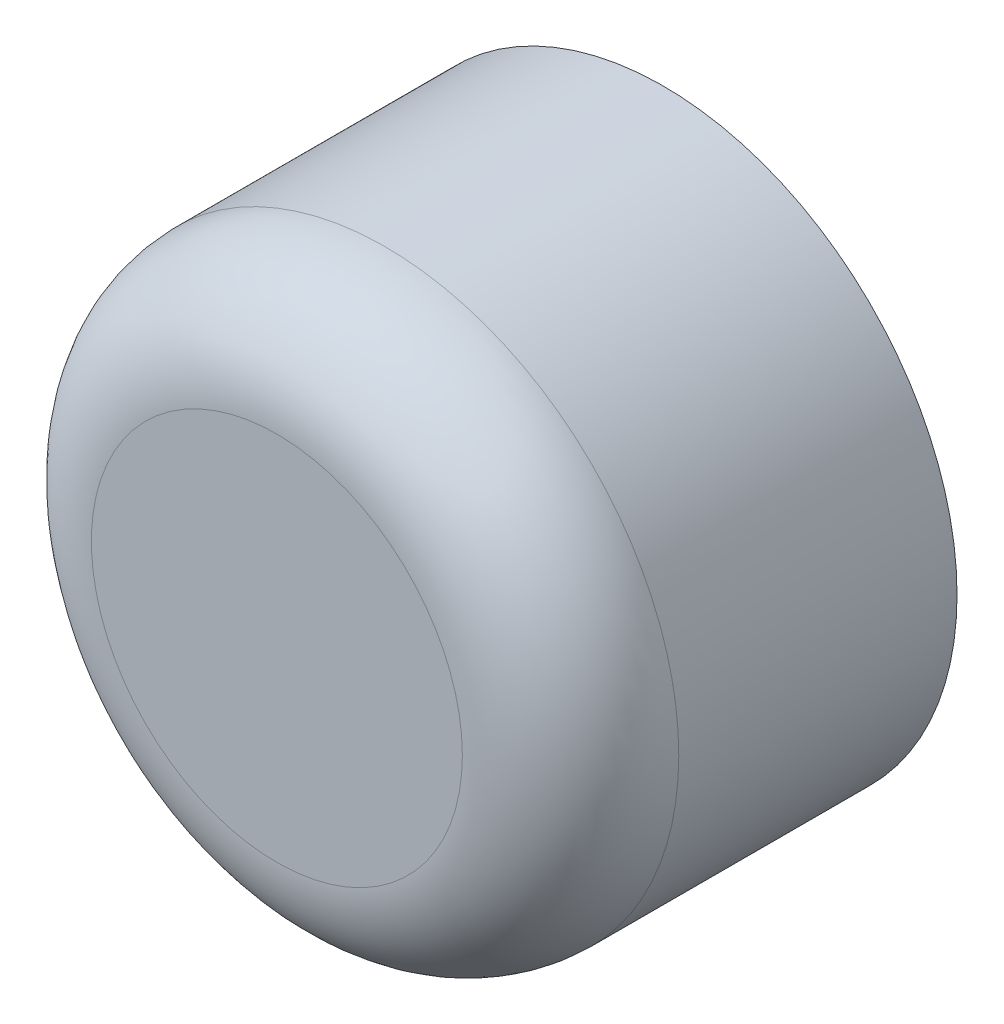
ISO-10303-21;
HEADER;
FILE_DESCRIPTION(('STEP AP214'),'2;1');
FILE_NAME('part.step','',(''),(''),'','','');
FILE_SCHEMA(('AUTOMOTIVE_DESIGN { 1 0 10303 214 1 1 1 1 }'));
ENDSEC;
DATA;
#1=APPLICATION_CONTEXT('core data for automotive mechanical design processes');
#2=APPLICATION_PROTOCOL_DEFINITION('international standard','automotive_design',2000,#1);
#3=PRODUCT_CONTEXT('',#1,'mechanical');
#4=PRODUCT('Part','Part','',(#3));
#5=PRODUCT_RELATED_PRODUCT_CATEGORY('part','',(#4));
#6=PRODUCT_DEFINITION_FORMATION('','',#4);
#7=PRODUCT_DEFINITION_CONTEXT('part definition',#1,'design');
#8=PRODUCT_DEFINITION('design','',#6,#7);
#9=PRODUCT_DEFINITION_SHAPE('','',#8);
#10=(LENGTH_UNIT() NAMED_UNIT(*) SI_UNIT(.MILLI.,.METRE.));
#11=(NAMED_UNIT(*) PLANE_ANGLE_UNIT() SI_UNIT($,.RADIAN.));
#12=(NAMED_UNIT(*) SI_UNIT($,.STERADIAN.) SOLID_ANGLE_UNIT());
#13=UNCERTAINTY_MEASURE_WITH_UNIT(LENGTH_MEASURE(1.E-05),#10,'distance_accuracy_value','');
#14=(GEOMETRIC_REPRESENTATION_CONTEXT(3) GLOBAL_UNCERTAINTY_ASSIGNED_CONTEXT((#13)) GLOBAL_UNIT_ASSIGNED_CONTEXT((#10,
#11,#12)) REPRESENTATION_CONTEXT('',''));
#15=CARTESIAN_POINT('',(0.,0.,0.));
#16=DIRECTION('',(0.,0.,1.));
#17=DIRECTION('',(1.,0.,0.));
#18=AXIS2_PLACEMENT_3D('',#15,#16,#17);
#19=CARTESIAN_POINT('',(0.,0.,25.));
#20=DIRECTION('',(0.,0.,-1.));
#21=DIRECTION('',(-1.,0.,0.));
#22=AXIS2_PLACEMENT_3D('',#19,#20,#21);
#23=CYLINDRICAL_SURFACE('',#22,19.);
#24=CARTESIAN_POINT('',(0.,0.,18.));
#25=DIRECTION('',(0.,0.,1.));
#26=DIRECTION('',(1.,0.,0.));
#27=AXIS2_PLACEMENT_3D('',#24,#25,#26);
#28=CIRCLE('',#27,19.);
#29=CARTESIAN_POINT('',(19.,0.,18.));
#30=VERTEX_POINT('',#29);
#31=EDGE_CURVE('E10',#30,#30,#28,.F.);
#32=ORIENTED_EDGE('',*,*,#31,.T.);
#33=EDGE_LOOP('',(#32));
#34=FACE_BOUND('',#33,.T.);
#35=CARTESIAN_POINT('',(0.,-19.,11.1));
#36=CARTESIAN_POINT('',(-0.0617320040500549,-18.9999995756223,11.0999972804819));
#37=CARTESIAN_POINT('',(-0.123507451000114,-18.999695924853,11.0947859408961));
#38=CARTESIAN_POINT('',(-0.24535321333721,-18.998513793972,11.0740713215878));
#39=CARTESIAN_POINT('',(-0.305421448691984,-18.9976346415817,11.0585560048509));
#40=CARTESIAN_POINT('',(-0.422070166304976,-18.9954009827337,11.017680001208));
#41=CARTESIAN_POINT('',(-0.478652446088216,-18.9940467237168,10.992324438481));
#42=CARTESIAN_POINT('',(-0.586742750131653,-18.9910152490377,10.9324958325482));
#43=CARTESIAN_POINT('',(-0.638251946769572,-18.9893381082587,10.8980249026999));
#44=CARTESIAN_POINT('',(-0.734816184503076,-18.9858469988556,10.8208944995453));
#45=CARTESIAN_POINT('',(-0.779863746133681,-18.9840328753186,10.7782256684934));
#46=CARTESIAN_POINT('',(-0.862162088976615,-18.9804735900862,10.6859297729961));
#47=CARTESIAN_POINT('',(-0.899412547300006,-18.978728431249,10.6363024205306));
#48=CARTESIAN_POINT('',(-0.965081566797601,-18.9755027123895,10.5314568441288));
#49=CARTESIAN_POINT('',(-0.993494031569768,-18.9740223353102,10.4762347956563));
#50=CARTESIAN_POINT('',(-1.04064149858644,-18.9714950896691,10.3617942282788));
#51=CARTESIAN_POINT('',(-1.05937659280397,-18.9704482169875,10.3025757473616));
#52=CARTESIAN_POINT('',(-1.08661705093427,-18.9689074875675,10.1818943610569));
#53=CARTESIAN_POINT('',(-1.09513396892365,-18.9684130062631,10.1204340717818));
#54=CARTESIAN_POINT('',(-1.10173197114491,-18.9680309500149,9.99695434914613));
#55=CARTESIAN_POINT('',(-1.09981315943117,-18.9681433690197,9.93493492136684));
#56=CARTESIAN_POINT('',(-1.08560377064927,-18.9689618558727,9.81217607706893));
#57=CARTESIAN_POINT('',(-1.0733256885909,-18.9696672085402,9.75143520881738));
#58=CARTESIAN_POINT('',(-1.03876566287628,-18.9715909430879,9.63287808265456));
#59=CARTESIAN_POINT('',(-1.01648366623108,-18.9728093276854,9.57506184023629));
#60=CARTESIAN_POINT('',(-0.9625340967885,-18.9756226384643,9.46395496787695));
#61=CARTESIAN_POINT('',(-0.930860844637545,-18.9772177923775,9.41066710162893));
#62=CARTESIAN_POINT('',(-0.85903197484002,-18.980604638557,9.31015984722272));
#63=CARTESIAN_POINT('',(-0.818876275819526,-18.9823963327088,9.26294051728828));
#64=CARTESIAN_POINT('',(-0.731151957191535,-18.9859775127357,9.17583801060137));
#65=CARTESIAN_POINT('',(-0.683572521402879,-18.9877669914869,9.1359657261379));
#66=CARTESIAN_POINT('',(-0.582389289587574,-18.9911395316736,9.06477312185726));
#67=CARTESIAN_POINT('',(-0.528785491721799,-18.9927225930461,9.03345280465085));
#68=CARTESIAN_POINT('',(-0.417068636149907,-18.9955040037363,8.98025417346377));
#69=CARTESIAN_POINT('',(-0.358955387652741,-18.9967023367653,8.95837625924045));
#70=CARTESIAN_POINT('',(-0.239872153805753,-18.9985790225836,8.9246906819236));
#71=CARTESIAN_POINT('',(-0.178902197101453,-18.9992573805856,8.91288291787486));
#72=CARTESIAN_POINT('',(-0.0559307862300104,-19.0000170003874,8.8996862882731));
#73=CARTESIAN_POINT('',(0.00606904645360722,-19.0000991253795,8.89828236057508));
#74=CARTESIAN_POINT('',(0.129423361025398,-18.9996593186888,8.90589391983453));
#75=CARTESIAN_POINT('',(0.190777845787524,-18.9991373896971,8.91490936037117));
#76=CARTESIAN_POINT('',(0.311057493825413,-18.9975487985834,8.94309127137715));
#77=CARTESIAN_POINT('',(0.369984278497294,-18.9964825066161,8.9622508443879));
#78=CARTESIAN_POINT('',(0.483785817705781,-18.9939251856388,9.01017015028812));
#79=CARTESIAN_POINT('',(0.538660540940977,-18.9924341533482,9.0389299573281));
#80=CARTESIAN_POINT('',(0.64286931375091,-18.9891928156946,9.10527177575751));
#81=CARTESIAN_POINT('',(0.692196940478747,-18.9874422151102,9.1428638614258));
#82=CARTESIAN_POINT('',(0.783846663377566,-18.98387979614,9.2257884504599));
#83=CARTESIAN_POINT('',(0.82616870007123,-18.9820679772347,9.27112101953563));
#84=CARTESIAN_POINT('',(0.902656775402082,-18.9785848423375,9.3683046603294));
#85=CARTESIAN_POINT('',(0.93681305281082,-18.9769136960337,9.42016342149935));
#86=CARTESIAN_POINT('',(0.995933291472939,-18.9739030484457,9.52888864037129));
#87=CARTESIAN_POINT('',(1.02089730286744,-18.9725635453525,9.58575507075581));
#88=CARTESIAN_POINT('',(1.06090742304525,-18.9703684589054,9.70284554444452));
#89=CARTESIAN_POINT('',(1.07595970663483,-18.9695125743143,9.76306747192779));
#90=CARTESIAN_POINT('',(1.09573927001406,-18.9683804030387,9.88518893563099));
#91=CARTESIAN_POINT('',(1.10046663495124,-18.9681041115743,9.94708845801189));
#92=CARTESIAN_POINT('',(1.09946136166685,-18.9681623996433,10.070710918238));
#93=CARTESIAN_POINT('',(1.09374407285783,-18.9684960827613,10.1324339819122));
#94=CARTESIAN_POINT('',(1.0720435722136,-18.9697348180291,10.2540422482185));
#95=CARTESIAN_POINT('',(1.05606034136719,-18.970639871237,10.313927447447));
#96=CARTESIAN_POINT('',(1.01428500598485,-18.9729191360926,10.4301626967544));
#97=CARTESIAN_POINT('',(0.988492908832591,-18.9742933473873,10.4865127494944));
#98=CARTESIAN_POINT('',(0.927834259495705,-18.9773560263943,10.5940843927976));
#99=CARTESIAN_POINT('',(0.892967959426748,-18.9790444853752,10.6453061257903));
#100=CARTESIAN_POINT('',(0.815094400602707,-18.9825482494595,10.7412446239999));
#101=CARTESIAN_POINT('',(0.772076163174159,-18.984363723517,10.7859524712889));
#102=CARTESIAN_POINT('',(0.679132394259068,-18.9879155565136,10.8675268067093));
#103=CARTESIAN_POINT('',(0.629205171759072,-18.9896518959454,10.9043913695299));
#104=CARTESIAN_POINT('',(0.523810839774369,-18.9928513664318,10.9692558986844));
#105=CARTESIAN_POINT('',(0.468337553215066,-18.9943141875265,10.997245832682));
#106=CARTESIAN_POINT('',(0.353511254108986,-18.9967974646851,11.0434806440717));
#107=CARTESIAN_POINT('',(0.294162893283999,-18.9978184403093,11.0617369729793));
#108=CARTESIAN_POINT('',(0.195374333112913,-18.9990344497459,11.0832241318225));
#109=CARTESIAN_POINT('',(0.156573223440549,-18.9993949289939,11.0895069884142));
#110=CARTESIAN_POINT('',(0.0785206019028414,-18.9998778389598,11.0978957850332));
#111=CARTESIAN_POINT('',(0.0392690905643024,-19.000000269956,11.1000017299455));
#112=CARTESIAN_POINT('',(0.,-19.,11.1));
#113=B_SPLINE_CURVE_WITH_KNOTS('',3,(#35,#36,#37,#38,#39,#40,#41,#42,#43,#44,#45,#46,#47,#48,
#49,#50,#51,#52,#53,#54,#55,#56,#57,#58,#59,#60,#61,#62,#63,#64,#65,#66,#67,#68,#69,#70,#71,#72,
#73,#74,#75,#76,#77,#78,#79,#80,#81,#82,#83,#84,#85,#86,#87,#88,#89,#90,#91,#92,#93,#94,#95,#96,
#97,#98,#99,#100,#101,#102,#103,#104,#105,#106,#107,#108,#109,#110,#111,#112),.UNSPECIFIED.,.T.,
.F.,(4,2,2,2,2,2,2,2,2,2,2,2,2,2,2,2,2,2,2,2,2,2,2,2,2,2,2,2,2,2,2,2,2,2,2,2,2,2,4),(0.,
0.185052660092687,0.370321878210842,0.555494748987009,0.740624725834711,0.925967294153065,
1.11131753624819,1.29679534989826,1.48227140074821,1.66753752858468,1.85280180914126,
2.03784294896751,2.22288506893505,2.40803932199883,2.59319535136758,2.77862371138395,
2.9640521280083,3.14948839423444,3.33492280140402,3.52008869352772,3.70525376069557,
3.890293087068,4.07533384268473,4.26058669311735,4.44584111626229,4.63131589476176,
4.81678966153569,5.00214777230673,5.18750435446081,5.37258875657755,5.5576735014474,
5.74275810699416,5.92783757073961,6.11316808604197,6.29854404253876,6.48412881650025,
6.66949476682296,6.78721098677799,6.90492706906251),.UNSPECIFIED.);
#114=CARTESIAN_POINT('',(0.,-19.,11.1));
#115=VERTEX_POINT('',#114);
#116=EDGE_CURVE('E57',#115,#115,#113,.T.);
#117=ORIENTED_EDGE('',*,*,#116,.F.);
#118=EDGE_LOOP('',(#117));
#119=FACE_BOUND('',#118,.T.);
#120=CARTESIAN_POINT('',(0.,0.,0.));
#121=DIRECTION('',(0.,0.,1.));
#122=DIRECTION('',(1.,0.,0.));
#123=AXIS2_PLACEMENT_3D('',#120,#121,#122);
#124=CIRCLE('',#123,19.);
#125=CARTESIAN_POINT('',(19.,0.,0.));
#126=VERTEX_POINT('',#125);
#127=EDGE_CURVE('E41',#126,#126,#124,.T.);
#128=ORIENTED_EDGE('',*,*,#127,.T.);
#129=EDGE_LOOP('',(#128));
#130=FACE_BOUND('',#129,.T.);
#131=ADVANCED_FACE('F30',(#34,#119,#130),#23,.T.);
#132=CARTESIAN_POINT('',(0.,0.,25.));
#133=DIRECTION('',(0.,0.,1.));
#134=DIRECTION('',(1.,0.,0.));
#135=AXIS2_PLACEMENT_3D('',#132,#133,#134);
#136=PLANE('',#135);
#137=CARTESIAN_POINT('',(0.,0.,25.));
#138=DIRECTION('',(0.,0.,1.));
#139=DIRECTION('',(1.,0.,0.));
#140=AXIS2_PLACEMENT_3D('',#137,#138,#139);
#141=CIRCLE('',#140,12.);
#142=CARTESIAN_POINT('',(12.,0.,25.));
#143=VERTEX_POINT('',#142);
#144=EDGE_CURVE('E37',#143,#143,#141,.T.);
#145=ORIENTED_EDGE('',*,*,#144,.T.);
#146=EDGE_LOOP('',(#145));
#147=FACE_BOUND('',#146,.T.);
#148=ADVANCED_FACE('F97',(#147),#136,.T.);
#149=CARTESIAN_POINT('',(0.,0.,0.));
#150=DIRECTION('',(0.,0.,1.));
#151=DIRECTION('',(1.,0.,0.));
#152=AXIS2_PLACEMENT_3D('',#149,#150,#151);
#153=PLANE('',#152);
#154=CARTESIAN_POINT('',(0.,0.,0.));
#155=DIRECTION('',(0.,0.,-1.));
#156=DIRECTION('',(-1.,0.,0.));
#157=AXIS2_PLACEMENT_3D('',#154,#155,#156);
#158=CIRCLE('',#157,10.);
#159=CARTESIAN_POINT('',(-10.,0.,0.));
#160=VERTEX_POINT('',#159);
#161=EDGE_CURVE('E48',#160,#160,#158,.T.);
#162=ORIENTED_EDGE('',*,*,#161,.F.);
#163=EDGE_LOOP('',(#162));
#164=FACE_BOUND('',#163,.T.);
#165=ORIENTED_EDGE('',*,*,#127,.F.);
#166=EDGE_LOOP('',(#165));
#167=FACE_BOUND('',#166,.T.);
#168=ADVANCED_FACE('F95',(#164,#167),#153,.F.);
#169=CARTESIAN_POINT('',(0.,0.,5.));
#170=DIRECTION('',(0.,0.,-1.));
#171=DIRECTION('',(-1.,0.,0.));
#172=AXIS2_PLACEMENT_3D('',#169,#170,#171);
#173=CYLINDRICAL_SURFACE('',#172,10.);
#174=CARTESIAN_POINT('',(0.,0.,5.));
#175=DIRECTION('',(0.,0.,-1.));
#176=DIRECTION('',(-1.,0.,0.));
#177=AXIS2_PLACEMENT_3D('',#174,#175,#176);
#178=CIRCLE('',#177,10.);
#179=CARTESIAN_POINT('',(-10.,0.,5.));
#180=VERTEX_POINT('',#179);
#181=EDGE_CURVE('E45',#180,#180,#178,.T.);
#182=ORIENTED_EDGE('',*,*,#181,.F.);
#183=EDGE_LOOP('',(#182));
#184=FACE_BOUND('',#183,.T.);
#185=ORIENTED_EDGE('',*,*,#161,.T.);
#186=EDGE_LOOP('',(#185));
#187=FACE_BOUND('',#186,.T.);
#188=ADVANCED_FACE('F91',(#184,#187),#173,.F.);
#189=CARTESIAN_POINT('',(0.,0.,5.));
#190=DIRECTION('',(0.,0.,-1.));
#191=DIRECTION('',(-1.,0.,0.));
#192=AXIS2_PLACEMENT_3D('',#189,#190,#191);
#193=PLANE('',#192);
#194=CARTESIAN_POINT('',(0.,0.,5.));
#195=DIRECTION('',(0.,0.,-1.));
#196=DIRECTION('',(-1.,0.,0.));
#197=AXIS2_PLACEMENT_3D('',#194,#195,#196);
#198=CIRCLE('',#197,3.);
#199=CARTESIAN_POINT('',(-3.,0.,5.));
#200=VERTEX_POINT('',#199);
#201=EDGE_CURVE('E54',#200,#200,#198,.T.);
#202=ORIENTED_EDGE('',*,*,#201,.F.);
#203=EDGE_LOOP('',(#202));
#204=FACE_BOUND('',#203,.T.);
#205=ORIENTED_EDGE('',*,*,#181,.T.);
#206=EDGE_LOOP('',(#205));
#207=FACE_BOUND('',#206,.T.);
#208=ADVANCED_FACE('F87',(#204,#207),#193,.T.);
#209=CARTESIAN_POINT('',(0.,0.,20.));
#210=DIRECTION('',(0.,0.,-1.));
#211=DIRECTION('',(-1.,0.,0.));
#212=AXIS2_PLACEMENT_3D('',#209,#210,#211);
#213=CYLINDRICAL_SURFACE('',#212,3.);
#214=CARTESIAN_POINT('',(0.,-3.,11.1));
#215=CARTESIAN_POINT('',(0.0596653603658477,-3.00000124874777,11.1000016959377));
#216=CARTESIAN_POINT('',(0.119318861047392,-2.99820433362878,11.0951301942859));
#217=CARTESIAN_POINT('',(0.236848244255451,-2.99121508676533,11.0758476944229));
#218=CARTESIAN_POINT('',(0.294724294806991,-2.98602307700504,11.0614376008315));
#219=CARTESIAN_POINT('',(0.40698713855009,-2.97280239953096,11.0236525816176));
#220=CARTESIAN_POINT('',(0.461380257103499,-2.96477905699958,11.0002944784406));
#221=CARTESIAN_POINT('',(0.56547335680578,-2.94669890184719,10.9453600789518));
#222=CARTESIAN_POINT('',(0.615172135653516,-2.93664157034718,10.9137816850185));
#223=CARTESIAN_POINT('',(0.710497168894281,-2.91507648167801,10.8419533651427));
#224=CARTESIAN_POINT('',(0.75590589164363,-2.90352893596448,10.8014267972003));
#225=CARTESIAN_POINT('',(0.839455790057788,-2.88048533673689,10.7134398983826));
#226=CARTESIAN_POINT('',(0.877594880931808,-2.86898929891452,10.6659775853424));
#227=CARTESIAN_POINT('',(0.946876023491567,-2.84689276879725,10.563376148578));
#228=CARTESIAN_POINT('',(0.977715943844815,-2.83633955824423,10.5080218172978));
#229=CARTESIAN_POINT('',(1.02955228614908,-2.81793972857028,10.3924637493466));
#230=CARTESIAN_POINT('',(1.0505524433536,-2.81009208269453,10.3322618630331));
#231=CARTESIAN_POINT('',(1.0812631510737,-2.798415961319,10.2112164474398));
#232=CARTESIAN_POINT('',(1.09138742706649,-2.79444077822038,10.1504925023863));
#233=CARTESIAN_POINT('',(1.10135267987145,-2.7905293041686,10.0280875242816));
#234=CARTESIAN_POINT('',(1.10119766744092,-2.79059143794103,9.96640687390785));
#235=CARTESIAN_POINT('',(1.09092609853663,-2.7946206462547,9.84756843096376));
#236=CARTESIAN_POINT('',(1.08137599754645,-2.79836566494697,9.79035277143228));
#237=CARTESIAN_POINT('',(1.05351920552002,-2.80897082219962,9.67840107819876));
#238=CARTESIAN_POINT('',(1.03521125437041,-2.81583140903281,9.62366540256746));
#239=CARTESIAN_POINT('',(0.990035328733109,-2.83203335044011,9.51704568337633));
#240=CARTESIAN_POINT('',(0.963016175829748,-2.84141799234525,9.46523256239848));
#241=CARTESIAN_POINT('',(0.90129006472429,-2.86159544268106,9.36670825972946));
#242=CARTESIAN_POINT('',(0.866580536276022,-2.87238872140381,9.31999879157187));
#243=CARTESIAN_POINT('',(0.787840621137831,-2.89501075010137,9.22986180651685));
#244=CARTESIAN_POINT('',(0.743355730941569,-2.90686155110834,9.1868359200932));
#245=CARTESIAN_POINT('',(0.647663117597077,-2.92966708861006,9.1087384983429));
#246=CARTESIAN_POINT('',(0.596454451658585,-2.94062169909304,9.07366808039577));
#247=CARTESIAN_POINT('',(0.48777977300081,-2.96060161705553,9.01206003152321));
#248=CARTESIAN_POINT('',(0.430235217521434,-2.96959731294347,8.98565066584854));
#249=CARTESIAN_POINT('',(0.311108672774423,-2.98442731277654,8.94301902737046));
#250=CARTESIAN_POINT('',(0.249528406901531,-2.99026295644358,8.92679243705791));
#251=CARTESIAN_POINT('',(0.127462862761651,-2.99788264484015,8.90574635971972));
#252=CARTESIAN_POINT('',(0.0670827891130076,-2.99985872688891,8.900385667251));
#253=CARTESIAN_POINT('',(-0.053739186977485,-3.0001264355405,8.89965479925089));
#254=CARTESIAN_POINT('',(-0.114181073749808,-2.99841883675149,8.90428252334522));
#255=CARTESIAN_POINT('',(-0.231108406159618,-2.99163788470485,8.92298191680917));
#256=CARTESIAN_POINT('',(-0.287657784812599,-2.98668929450055,8.93670373119986));
#257=CARTESIAN_POINT('',(-0.397615636671328,-2.97404894323754,8.97274602109412));
#258=CARTESIAN_POINT('',(-0.451023700166589,-2.96635682527047,8.99506761538228));
#259=CARTESIAN_POINT('',(-0.554908427976737,-2.94871738617956,9.04837843534859));
#260=CARTESIAN_POINT('',(-0.605255980194477,-2.93871137811358,9.07959925201961));
#261=CARTESIAN_POINT('',(-0.700162701835578,-2.91755723487567,9.14955855671286));
#262=CARTESIAN_POINT('',(-0.744719793590156,-2.90640869230438,9.18829973074099));
#263=CARTESIAN_POINT('',(-0.829360890855198,-2.88343377289124,9.274729050306));
#264=CARTESIAN_POINT('',(-0.869060195620298,-2.87160406892303,9.32279402390501));
#265=CARTESIAN_POINT('',(-0.939899669781491,-2.84920568198054,9.42514199796859));
#266=CARTESIAN_POINT('',(-0.971039244708762,-2.83863708661841,9.47942542993117));
#267=CARTESIAN_POINT('',(-1.02386254843665,-2.8200170700311,9.5930149486137));
#268=CARTESIAN_POINT('',(-1.04552125182698,-2.81197232633534,9.65233384045757));
#269=CARTESIAN_POINT('',(-1.0784092993252,-2.79952649364981,9.77415153924039));
#270=CARTESIAN_POINT('',(-1.08964471233036,-2.79512328456104,9.83664847339413));
#271=CARTESIAN_POINT('',(-1.10083806784982,-2.79073255817453,9.95890054401552));
#272=CARTESIAN_POINT('',(-1.1014482886697,-2.79048965654101,10.0185873167862));
#273=CARTESIAN_POINT('',(-1.09303145247646,-2.7937971077441,10.1371646200869));
#274=CARTESIAN_POINT('',(-1.0840052287752,-2.79734713258729,10.1960552190201));
#275=CARTESIAN_POINT('',(-1.05707078841707,-2.80763225279226,10.3097076343864));
#276=CARTESIAN_POINT('',(-1.03941724094369,-2.81427578061567,10.3645387880301));
#277=CARTESIAN_POINT('',(-0.99594942617361,-2.82994981114228,10.4704956611847));
#278=CARTESIAN_POINT('',(-0.970133140652864,-2.83898090407659,10.5216204604584));
#279=CARTESIAN_POINT('',(-0.909551414968638,-2.85898260515673,10.62153059325));
#280=CARTESIAN_POINT('',(-0.874398504847365,-2.87002834990345,10.6700657713279));
#281=CARTESIAN_POINT('',(-0.796752399809457,-2.89254526375225,10.7607572977932));
#282=CARTESIAN_POINT('',(-0.754256924972871,-2.90401656412106,10.8029116572399));
#283=CARTESIAN_POINT('',(-0.660548639786975,-2.92679216754413,10.8818239918814));
#284=CARTESIAN_POINT('',(-0.609002616112062,-2.93805837226636,10.9181989614741));
#285=CARTESIAN_POINT('',(-0.500136860580026,-2.95853467976325,10.9817509381987));
#286=CARTESIAN_POINT('',(-0.442817105159343,-2.96774477414609,11.00892790779));
#287=CARTESIAN_POINT('',(-0.322493606369647,-2.9832468592136,11.0536679906505));
#288=CARTESIAN_POINT('',(-0.259384186418024,-2.9894608548018,11.0709760902518));
#289=CARTESIAN_POINT('',(-0.130844392872352,-2.99783583601898,11.0941386087502));
#290=CARTESIAN_POINT('',(-0.0654150686575993,-2.99999863091548,11.0999981406317));
#291=CARTESIAN_POINT('',(0.,-3.,11.1));
#292=B_SPLINE_CURVE_WITH_KNOTS('',3,(#214,#215,#216,#217,#218,#219,#220,#221,#222,#223,#224,
#225,#226,#227,#228,#229,#230,#231,#232,#233,#234,#235,#236,#237,#238,#239,#240,#241,#242,#243,
#244,#245,#246,#247,#248,#249,#250,#251,#252,#253,#254,#255,#256,#257,#258,#259,#260,#261,#262,
#263,#264,#265,#266,#267,#268,#269,#270,#271,#272,#273,#274,#275,#276,#277,#278,#279,#280,#281,
#282,#283,#284,#285,#286,#287,#288,#289,#290,#291),.UNSPECIFIED.,.T.,.F.,(4,2,2,2,2,2,2,2,2,2,2,
2,2,2,2,2,2,2,2,2,2,2,2,2,2,2,2,2,2,2,2,2,2,2,2,2,2,2,4),(0.,0.17875490773974,0.357492865169348,
0.535896427659756,0.714345559175,0.899369895863448,1.08444721440599,1.2762026915726,
1.46788531772088,1.65198550181501,1.83601385439912,2.00958682077848,2.18318476902303,
2.35997410918523,2.53682262453215,2.72499447820699,2.91319274508038,3.10406398185192,
3.29485423420864,3.47588192225445,3.65687154732447,3.83127381950643,4.00569878814085,
4.18515848390998,4.36468239466834,4.55415458027959,4.74363992131372,4.93362244947296,
5.12349429191199,5.3016658147168,5.4798219313811,5.65301061537202,5.82624215351945,
6.00825949460879,6.190333455313,6.38165835431487,6.57298403417707,6.76905241099166,
6.96503320271032),.UNSPECIFIED.);
#293=CARTESIAN_POINT('',(0.,-3.,11.1));
#294=VERTEX_POINT('',#293);
#295=EDGE_CURVE('E67',#294,#294,#292,.T.);
#296=ORIENTED_EDGE('',*,*,#295,.F.);
#297=EDGE_LOOP('',(#296));
#298=FACE_BOUND('',#297,.T.);
#299=CARTESIAN_POINT('',(0.,0.,20.));
#300=DIRECTION('',(0.,0.,-1.));
#301=DIRECTION('',(-1.,0.,0.));
#302=AXIS2_PLACEMENT_3D('',#299,#300,#301);
#303=CIRCLE('',#302,3.);
#304=CARTESIAN_POINT('',(-3.,0.,20.));
#305=VERTEX_POINT('',#304);
#306=EDGE_CURVE('E51',#305,#305,#303,.T.);
#307=ORIENTED_EDGE('',*,*,#306,.F.);
#308=EDGE_LOOP('',(#307));
#309=FACE_BOUND('',#308,.T.);
#310=ORIENTED_EDGE('',*,*,#201,.T.);
#311=EDGE_LOOP('',(#310));
#312=FACE_BOUND('',#311,.T.);
#313=ADVANCED_FACE('F83',(#298,#309,#312),#213,.F.);
#314=CARTESIAN_POINT('',(0.,0.,20.));
#315=DIRECTION('',(0.,0.,-1.));
#316=DIRECTION('',(-1.,0.,0.));
#317=AXIS2_PLACEMENT_3D('',#314,#315,#316);
#318=PLANE('',#317);
#319=ORIENTED_EDGE('',*,*,#306,.T.);
#320=EDGE_LOOP('',(#319));
#321=FACE_BOUND('',#320,.T.);
#322=ADVANCED_FACE('F78',(#321),#318,.T.);
#323=CARTESIAN_POINT('',(0.,-19.001,10.));
#324=DIRECTION('',(0.,1.,0.));
#325=DIRECTION('',(0.,0.,1.));
#326=AXIS2_PLACEMENT_3D('',#323,#324,#325);
#327=CYLINDRICAL_SURFACE('',#326,1.1);
#328=ORIENTED_EDGE('',*,*,#295,.T.);
#329=EDGE_LOOP('',(#328));
#330=FACE_BOUND('',#329,.T.);
#331=ORIENTED_EDGE('',*,*,#116,.T.);
#332=EDGE_LOOP('',(#331));
#333=FACE_BOUND('',#332,.T.);
#334=ADVANCED_FACE('F72',(#330,#333),#327,.F.);
#335=CARTESIAN_POINT('',(0.,0.,18.));
#336=DIRECTION('',(0.,0.,1.));
#337=DIRECTION('',(1.,0.,0.));
#338=AXIS2_PLACEMENT_3D('',#335,#336,#337);
#339=TOROIDAL_SURFACE('',#338,12.,7.);
#340=ORIENTED_EDGE('',*,*,#31,.F.);
#341=EDGE_LOOP('',(#340));
#342=FACE_BOUND('',#341,.T.);
#343=ORIENTED_EDGE('',*,*,#144,.F.);
#344=EDGE_LOOP('',(#343));
#345=FACE_BOUND('',#344,.T.);
#346=ADVANCED_FACE('F32',(#342,#345),#339,.T.);
#347=CLOSED_SHELL('',(#131,#148,#168,#188,#208,#313,#322,#334,#346));
#348=MANIFOLD_SOLID_BREP('B2',#347);
#349=ADVANCED_BREP_SHAPE_REPRESENTATION('',(#18,#348),#14);
#350=SHAPE_DEFINITION_REPRESENTATION(#9,#349);
ENDSEC;
END-ISO-10303-21;
